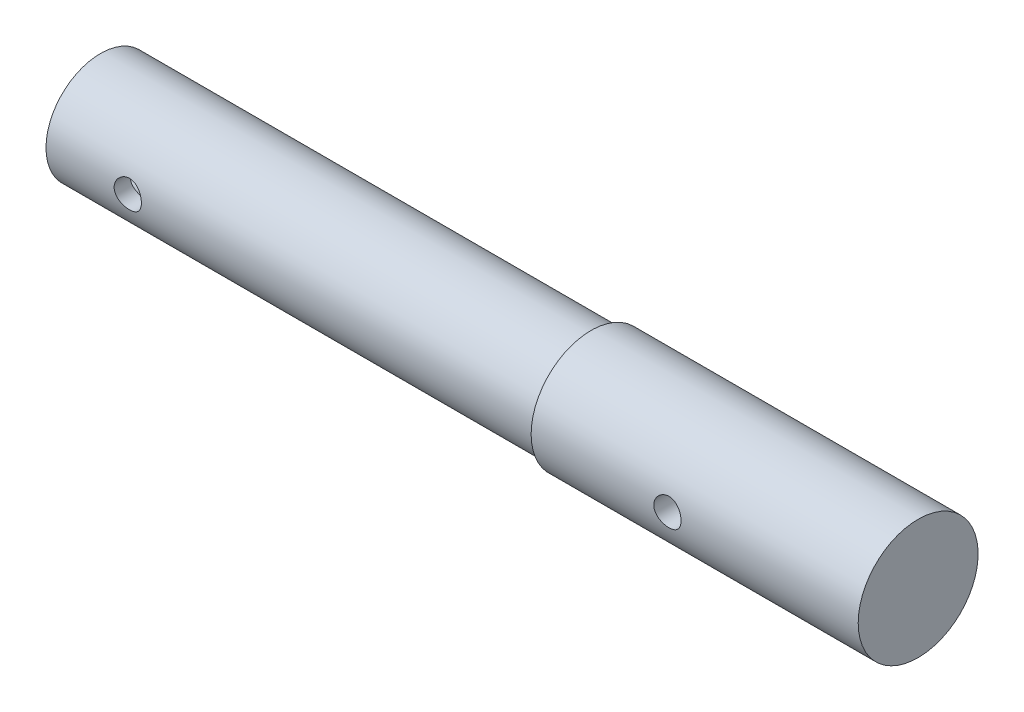
ISO-10303-21;
HEADER;
FILE_DESCRIPTION(('STEP AP214'),'2;1');
FILE_NAME('part.step','',(''),(''),'','','');
FILE_SCHEMA(('AUTOMOTIVE_DESIGN { 1 0 10303 214 1 1 1 1 }'));
ENDSEC;
DATA;
#1=APPLICATION_CONTEXT('core data for automotive mechanical design processes');
#2=APPLICATION_PROTOCOL_DEFINITION('international standard','automotive_design',2000,#1);
#3=PRODUCT_CONTEXT('',#1,'mechanical');
#4=PRODUCT('Part','Part','',(#3));
#5=PRODUCT_RELATED_PRODUCT_CATEGORY('part','',(#4));
#6=PRODUCT_DEFINITION_FORMATION('','',#4);
#7=PRODUCT_DEFINITION_CONTEXT('part definition',#1,'design');
#8=PRODUCT_DEFINITION('design','',#6,#7);
#9=PRODUCT_DEFINITION_SHAPE('','',#8);
#10=(LENGTH_UNIT() NAMED_UNIT(*) SI_UNIT(.MILLI.,.METRE.));
#11=(NAMED_UNIT(*) PLANE_ANGLE_UNIT() SI_UNIT($,.RADIAN.));
#12=(NAMED_UNIT(*) SI_UNIT($,.STERADIAN.) SOLID_ANGLE_UNIT());
#13=UNCERTAINTY_MEASURE_WITH_UNIT(LENGTH_MEASURE(1.E-05),#10,'distance_accuracy_value','');
#14=(GEOMETRIC_REPRESENTATION_CONTEXT(3) GLOBAL_UNCERTAINTY_ASSIGNED_CONTEXT((#13)) GLOBAL_UNIT_ASSIGNED_CONTEXT((#10,
#11,#12)) REPRESENTATION_CONTEXT('',''));
#15=CARTESIAN_POINT('',(0.,0.,0.));
#16=DIRECTION('',(0.,0.,1.));
#17=DIRECTION('',(1.,0.,0.));
#18=AXIS2_PLACEMENT_3D('',#15,#16,#17);
#19=CARTESIAN_POINT('',(0.,0.,0.));
#20=DIRECTION('',(-1.,0.,0.));
#21=DIRECTION('',(0.,0.,1.));
#22=AXIS2_PLACEMENT_3D('',#19,#20,#21);
#23=PLANE('',#22);
#24=CARTESIAN_POINT('',(0.,0.,0.));
#25=DIRECTION('',(-1.,0.,0.));
#26=DIRECTION('',(0.,0.,1.));
#27=AXIS2_PLACEMENT_3D('',#24,#25,#26);
#28=CIRCLE('',#27,11.);
#29=CARTESIAN_POINT('',(0.,0.,11.));
#30=VERTEX_POINT('',#29);
#31=EDGE_CURVE('E48',#30,#30,#28,.T.);
#32=ORIENTED_EDGE('',*,*,#31,.F.);
#33=EDGE_LOOP('',(#32));
#34=FACE_BOUND('',#33,.T.);
#35=ADVANCED_FACE('F32',(#34),#23,.F.);
#36=CARTESIAN_POINT('',(-150.,0.,0.));
#37=DIRECTION('',(-1.,0.,0.));
#38=DIRECTION('',(0.,0.,1.));
#39=AXIS2_PLACEMENT_3D('',#36,#37,#38);
#40=CYLINDRICAL_SURFACE('',#39,11.);
#41=CARTESIAN_POINT('',(-32.5,0.,-11.));
#42=CARTESIAN_POINT('',(-32.5000045318264,0.138518278596904,-10.9999974735185));
#43=CARTESIAN_POINT('',(-32.5115512275769,0.277090172258008,-10.9973570934613));
#44=CARTESIAN_POINT('',(-32.5573794760617,0.550288594599323,-10.987079320306));
#45=CARTESIAN_POINT('',(-32.5916763959553,0.684912392220729,-10.9794385496265));
#46=CARTESIAN_POINT('',(-32.6818680486319,0.946227671984917,-10.9600095312294));
#47=CARTESIAN_POINT('',(-32.7377393279807,1.07292759495648,-10.9482257885674));
#48=CARTESIAN_POINT('',(-32.8694171133809,1.31515227582566,-10.921778201627));
#49=CARTESIAN_POINT('',(-32.9452234208424,1.43067714503182,-10.9071143860398));
#50=CARTESIAN_POINT('',(-33.1160020446067,1.64926760444638,-10.8762265816814));
#51=CARTESIAN_POINT('',(-33.211252573475,1.75211293892049,-10.8599819758326));
#52=CARTESIAN_POINT('',(-33.4176189741372,1.9405138981661,-10.827906511833));
#53=CARTESIAN_POINT('',(-33.5287363506945,2.02606788121784,-10.8120756930933));
#54=CARTESIAN_POINT('',(-33.7653320552837,2.17844599401787,-10.7824158369221));
#55=CARTESIAN_POINT('',(-33.8909669963058,2.24503254356575,-10.7686131580577));
#56=CARTESIAN_POINT('',(-34.1520095005816,2.3560606971787,-10.7448696147509));
#57=CARTESIAN_POINT('',(-34.2874157920616,2.40050517717749,-10.7349282488168));
#58=CARTESIAN_POINT('',(-34.5617591871165,2.46525349412718,-10.7202434469831));
#59=CARTESIAN_POINT('',(-34.7005992631225,2.48594892680754,-10.715415797339));
#60=CARTESIAN_POINT('',(-34.9798582272131,2.50382988451487,-10.7112523406768));
#61=CARTESIAN_POINT('',(-35.1202769026623,2.50101853886553,-10.711915802658));
#62=CARTESIAN_POINT('',(-35.3957728833487,2.47228016958762,-10.7185835035919));
#63=CARTESIAN_POINT('',(-35.5309009061949,2.44681104599438,-10.7244819412976));
#64=CARTESIAN_POINT('',(-35.7949144861548,2.37420684920502,-10.7407873672743));
#65=CARTESIAN_POINT('',(-35.9237996676272,2.32707047404288,-10.7511946264744));
#66=CARTESIAN_POINT('',(-36.1729406718105,2.21205734402544,-10.7754474384537));
#67=CARTESIAN_POINT('',(-36.2931135177637,2.14400712086008,-10.7893215597825));
#68=CARTESIAN_POINT('',(-36.5205025531111,1.98921977920408,-10.8189276843241));
#69=CARTESIAN_POINT('',(-36.6277168402639,1.90247992237134,-10.8346599596346));
#70=CARTESIAN_POINT('',(-36.828778561821,1.71036518003517,-10.8666615287251));
#71=CARTESIAN_POINT('',(-36.9222544265164,1.60460166742828,-10.882934773515));
#72=CARTESIAN_POINT('',(-37.0902058887071,1.37871229840973,-10.9138502597158));
#73=CARTESIAN_POINT('',(-37.1646810866995,1.25858614009081,-10.9284924668293));
#74=CARTESIAN_POINT('',(-37.2926203879715,1.00690799179916,-10.9545497424637));
#75=CARTESIAN_POINT('',(-37.3460327736223,0.875328834348164,-10.9659568484873));
#76=CARTESIAN_POINT('',(-37.4298840058679,0.604745122491704,-10.9841998956698));
#77=CARTESIAN_POINT('',(-37.4603264658222,0.465741739663725,-10.9910365557784));
#78=CARTESIAN_POINT('',(-37.4968262374727,0.187439840192737,-10.9992650071756));
#79=CARTESIAN_POINT('',(-37.5033906913167,0.0482110923370417,-11.0007700184113));
#80=CARTESIAN_POINT('',(-37.4933269601471,-0.229353886680101,-10.9984842255063));
#81=CARTESIAN_POINT('',(-37.476700480594,-0.367690182720856,-10.9946938107912));
#82=CARTESIAN_POINT('',(-37.4211468330946,-0.637841677218458,-10.9823148103741));
#83=CARTESIAN_POINT('',(-37.3824884535563,-0.769715036814425,-10.973784087055));
#84=CARTESIAN_POINT('',(-37.2842689725429,-1.0251039308776,-10.9528806132367));
#85=CARTESIAN_POINT('',(-37.2247059957467,-1.14861871432289,-10.9405075180554));
#86=CARTESIAN_POINT('',(-37.0853308564447,-1.38586085256056,-10.9130143275095));
#87=CARTESIAN_POINT('',(-37.0052243732268,-1.49941068522719,-10.8978552985532));
#88=CARTESIAN_POINT('',(-36.8274206715598,-1.71163773579052,-10.866546095646));
#89=CARTESIAN_POINT('',(-36.7297209734532,-1.8103128535797,-10.8503957821912));
#90=CARTESIAN_POINT('',(-36.5171690348666,-1.99201706218096,-10.8185287714487));
#91=CARTESIAN_POINT('',(-36.4020127582132,-2.07469366594062,-10.8028272119253));
#92=CARTESIAN_POINT('',(-36.1591536093297,-2.21953814406553,-10.7740023321604));
#93=CARTESIAN_POINT('',(-36.0314512920404,-2.28170692501017,-10.7608788979592));
#94=CARTESIAN_POINT('',(-35.7678195304311,-2.38333597241928,-10.7388274870674));
#95=CARTESIAN_POINT('',(-35.6319426762567,-2.42292716221705,-10.7298753781702));
#96=CARTESIAN_POINT('',(-35.3552330933009,-2.47865258340365,-10.7171411058581));
#97=CARTESIAN_POINT('',(-35.2144012348636,-2.49479091341614,-10.7133580391079));
#98=CARTESIAN_POINT('',(-34.9353413806891,-2.50296739214165,-10.7114502943222));
#99=CARTESIAN_POINT('',(-34.7971304006664,-2.49556548501071,-10.7131941458177));
#100=CARTESIAN_POINT('',(-34.5239810898117,-2.45813115403283,-10.7218446846914));
#101=CARTESIAN_POINT('',(-34.3890427138895,-2.42809904217009,-10.7287513008948));
#102=CARTESIAN_POINT('',(-34.1267566026337,-2.34653692360609,-10.7468826027048));
#103=CARTESIAN_POINT('',(-33.9993803088585,-2.29509457527995,-10.758089666867));
#104=CARTESIAN_POINT('',(-33.7549852930994,-2.1722453660688,-10.783564723281));
#105=CARTESIAN_POINT('',(-33.6379677496745,-2.10083623731223,-10.7978330631966));
#106=CARTESIAN_POINT('',(-33.4148655723447,-1.9382499689105,-10.828211072634));
#107=CARTESIAN_POINT('',(-33.3090742777926,-1.84667645642835,-10.8443540558786));
#108=CARTESIAN_POINT('',(-33.114176814918,-1.64715628932418,-10.8764454859305));
#109=CARTESIAN_POINT('',(-33.025074529034,-1.53920583540676,-10.8923938866665));
#110=CARTESIAN_POINT('',(-32.8648619397663,-1.30814060515057,-10.9225693389041));
#111=CARTESIAN_POINT('',(-32.7940261766669,-1.1848316218762,-10.9367686161711));
#112=CARTESIAN_POINT('',(-32.674200029337,-0.927755967711694,-10.9615640551399));
#113=CARTESIAN_POINT('',(-32.6251920052133,-0.793997844337698,-10.9721631246672));
#114=CARTESIAN_POINT('',(-32.5587720938239,-0.550163071539624,-10.9867559512784));
#115=CARTESIAN_POINT('',(-32.5367760123107,-0.441368111138491,-10.9916908558499));
#116=CARTESIAN_POINT('',(-32.5073885264207,-0.221726814930917,-10.9983138080738));
#117=CARTESIAN_POINT('',(-32.4999963723808,-0.110880584717101,-11.0000020223883));
#118=CARTESIAN_POINT('',(-32.5,0.,-11.));
#119=B_SPLINE_CURVE_WITH_KNOTS('',3,(#41,#42,#43,#44,#45,#46,#47,#48,#49,#50,#51,#52,#53,#54,
#55,#56,#57,#58,#59,#60,#61,#62,#63,#64,#65,#66,#67,#68,#69,#70,#71,#72,#73,#74,#75,#76,#77,#78,
#79,#80,#81,#82,#83,#84,#85,#86,#87,#88,#89,#90,#91,#92,#93,#94,#95,#96,#97,#98,#99,#100,#101,
#102,#103,#104,#105,#106,#107,#108,#109,#110,#111,#112,#113,#114,#115,#116,#117,#118),
.UNSPECIFIED.,.T.,.F.,(4,2,2,2,2,2,2,2,2,2,2,2,2,2,2,2,2,2,2,2,2,2,2,2,2,2,2,2,2,2,2,2,2,2,2,2,
2,2,4),(0.,0.415148849633315,0.830578406996929,1.24555761755319,1.66053269430525,
2.08192389396808,2.50335508365802,2.92985362973413,3.35629676538239,3.77560244898082,
4.19485231368758,4.60581714174235,5.01680666753971,5.43130157438851,5.84585725297979,
6.27011531803704,6.69438230269862,7.11968464096647,7.54492006169895,7.96106941916762,
8.37718817463627,8.78833576149036,9.19952024123083,9.61696129328768,10.0344612272567,
10.460313215404,10.8861463755948,11.3094844190899,11.732748471094,12.1460204395145,
12.5592867105954,12.9708773657615,13.382514789318,13.8031102578591,14.2238034502007,
14.6504927745347,15.0768366452215,15.4091704772436,15.74148724914),.UNSPECIFIED.);
#120=CARTESIAN_POINT('',(-32.5,0.,-11.));
#121=VERTEX_POINT('',#120);
#122=EDGE_CURVE('E10',#121,#121,#119,.T.);
#123=ORIENTED_EDGE('',*,*,#122,.T.);
#124=EDGE_LOOP('',(#123));
#125=FACE_BOUND('',#124,.T.);
#126=CARTESIAN_POINT('',(-32.5,0.,11.));
#127=CARTESIAN_POINT('',(-32.5000045318264,-0.138518278596904,10.9999974735185));
#128=CARTESIAN_POINT('',(-32.5115512275769,-0.277090172258008,10.9973570934613));
#129=CARTESIAN_POINT('',(-32.5573794760617,-0.550288594599323,10.987079320306));
#130=CARTESIAN_POINT('',(-32.5916763959553,-0.684912392220729,10.9794385496265));
#131=CARTESIAN_POINT('',(-32.6818680486319,-0.946227671984917,10.9600095312294));
#132=CARTESIAN_POINT('',(-32.7377393279807,-1.07292759495648,10.9482257885674));
#133=CARTESIAN_POINT('',(-32.8694171133809,-1.31515227582566,10.921778201627));
#134=CARTESIAN_POINT('',(-32.9452234208424,-1.43067714503182,10.9071143860398));
#135=CARTESIAN_POINT('',(-33.1160020446067,-1.64926760444638,10.8762265816814));
#136=CARTESIAN_POINT('',(-33.211252573475,-1.75211293892049,10.8599819758326));
#137=CARTESIAN_POINT('',(-33.4176189741372,-1.9405138981661,10.827906511833));
#138=CARTESIAN_POINT('',(-33.5287363506945,-2.02606788121784,10.8120756930933));
#139=CARTESIAN_POINT('',(-33.7653320552837,-2.17844599401787,10.7824158369221));
#140=CARTESIAN_POINT('',(-33.8909669963058,-2.24503254356575,10.7686131580577));
#141=CARTESIAN_POINT('',(-34.1520095005816,-2.3560606971787,10.7448696147509));
#142=CARTESIAN_POINT('',(-34.2874157920616,-2.40050517717749,10.7349282488168));
#143=CARTESIAN_POINT('',(-34.5617591871165,-2.46525349412718,10.7202434469831));
#144=CARTESIAN_POINT('',(-34.7005992631225,-2.48594892680754,10.715415797339));
#145=CARTESIAN_POINT('',(-34.9798582272131,-2.50382988451487,10.7112523406768));
#146=CARTESIAN_POINT('',(-35.1202769026623,-2.50101853886553,10.711915802658));
#147=CARTESIAN_POINT('',(-35.3957728833487,-2.47228016958762,10.7185835035919));
#148=CARTESIAN_POINT('',(-35.5309009061949,-2.44681104599438,10.7244819412976));
#149=CARTESIAN_POINT('',(-35.7949144861548,-2.37420684920502,10.7407873672743));
#150=CARTESIAN_POINT('',(-35.9237996676272,-2.32707047404288,10.7511946264744));
#151=CARTESIAN_POINT('',(-36.1729406718105,-2.21205734402544,10.7754474384537));
#152=CARTESIAN_POINT('',(-36.2931135177637,-2.14400712086008,10.7893215597825));
#153=CARTESIAN_POINT('',(-36.5205025531111,-1.98921977920408,10.8189276843241));
#154=CARTESIAN_POINT('',(-36.6277168402639,-1.90247992237134,10.8346599596346));
#155=CARTESIAN_POINT('',(-36.828778561821,-1.71036518003517,10.8666615287251));
#156=CARTESIAN_POINT('',(-36.9222544265164,-1.60460166742828,10.882934773515));
#157=CARTESIAN_POINT('',(-37.0902058887071,-1.37871229840973,10.9138502597158));
#158=CARTESIAN_POINT('',(-37.1646810866995,-1.25858614009081,10.9284924668293));
#159=CARTESIAN_POINT('',(-37.2926203879715,-1.00690799179916,10.9545497424637));
#160=CARTESIAN_POINT('',(-37.3460327736223,-0.875328834348164,10.9659568484873));
#161=CARTESIAN_POINT('',(-37.4298840058679,-0.604745122491704,10.9841998956698));
#162=CARTESIAN_POINT('',(-37.4603264658222,-0.465741739663725,10.9910365557784));
#163=CARTESIAN_POINT('',(-37.4968262374727,-0.187439840192737,10.9992650071756));
#164=CARTESIAN_POINT('',(-37.5033906913167,-0.048211092337042,11.0007700184113));
#165=CARTESIAN_POINT('',(-37.4933269601471,0.229353886680101,10.9984842255063));
#166=CARTESIAN_POINT('',(-37.476700480594,0.367690182720856,10.9946938107912));
#167=CARTESIAN_POINT('',(-37.4211468330946,0.637841677218458,10.9823148103741));
#168=CARTESIAN_POINT('',(-37.3824884535563,0.769715036814425,10.973784087055));
#169=CARTESIAN_POINT('',(-37.2842689725429,1.0251039308776,10.9528806132367));
#170=CARTESIAN_POINT('',(-37.2247059957467,1.14861871432289,10.9405075180554));
#171=CARTESIAN_POINT('',(-37.0853308564447,1.38586085256056,10.9130143275095));
#172=CARTESIAN_POINT('',(-37.0052243732268,1.49941068522719,10.8978552985532));
#173=CARTESIAN_POINT('',(-36.8274206715598,1.71163773579052,10.866546095646));
#174=CARTESIAN_POINT('',(-36.7297209734532,1.8103128535797,10.8503957821912));
#175=CARTESIAN_POINT('',(-36.5171690348666,1.99201706218096,10.8185287714487));
#176=CARTESIAN_POINT('',(-36.4020127582132,2.07469366594062,10.8028272119253));
#177=CARTESIAN_POINT('',(-36.1591536093297,2.21953814406553,10.7740023321604));
#178=CARTESIAN_POINT('',(-36.0314512920404,2.28170692501017,10.7608788979592));
#179=CARTESIAN_POINT('',(-35.7678195304311,2.38333597241928,10.7388274870674));
#180=CARTESIAN_POINT('',(-35.6319426762567,2.42292716221705,10.7298753781702));
#181=CARTESIAN_POINT('',(-35.3552330933009,2.47865258340365,10.7171411058581));
#182=CARTESIAN_POINT('',(-35.2144012348636,2.49479091341614,10.7133580391079));
#183=CARTESIAN_POINT('',(-34.9353413806891,2.50296739214165,10.7114502943222));
#184=CARTESIAN_POINT('',(-34.7971304006664,2.49556548501071,10.7131941458177));
#185=CARTESIAN_POINT('',(-34.5239810898117,2.45813115403283,10.7218446846914));
#186=CARTESIAN_POINT('',(-34.3890427138895,2.42809904217009,10.7287513008948));
#187=CARTESIAN_POINT('',(-34.1267566026337,2.34653692360609,10.7468826027048));
#188=CARTESIAN_POINT('',(-33.9993803088585,2.29509457527995,10.758089666867));
#189=CARTESIAN_POINT('',(-33.7549852930994,2.1722453660688,10.783564723281));
#190=CARTESIAN_POINT('',(-33.6379677496745,2.10083623731223,10.7978330631966));
#191=CARTESIAN_POINT('',(-33.4148655723447,1.9382499689105,10.828211072634));
#192=CARTESIAN_POINT('',(-33.3090742777926,1.84667645642835,10.8443540558786));
#193=CARTESIAN_POINT('',(-33.114176814918,1.64715628932418,10.8764454859305));
#194=CARTESIAN_POINT('',(-33.025074529034,1.53920583540676,10.8923938866665));
#195=CARTESIAN_POINT('',(-32.8648619397663,1.30814060515057,10.9225693389041));
#196=CARTESIAN_POINT('',(-32.7940261766669,1.1848316218762,10.9367686161711));
#197=CARTESIAN_POINT('',(-32.674200029337,0.927755967711693,10.9615640551399));
#198=CARTESIAN_POINT('',(-32.6251920052133,0.793997844337699,10.9721631246672));
#199=CARTESIAN_POINT('',(-32.5587720938239,0.550163071539624,10.9867559512784));
#200=CARTESIAN_POINT('',(-32.5367760123107,0.44136811113849,10.9916908558499));
#201=CARTESIAN_POINT('',(-32.5073885264207,0.221726814930917,10.9983138080738));
#202=CARTESIAN_POINT('',(-32.4999963723808,0.110880584717101,11.0000020223883));
#203=CARTESIAN_POINT('',(-32.5,0.,11.));
#204=B_SPLINE_CURVE_WITH_KNOTS('',3,(#126,#127,#128,#129,#130,#131,#132,#133,#134,#135,#136,
#137,#138,#139,#140,#141,#142,#143,#144,#145,#146,#147,#148,#149,#150,#151,#152,#153,#154,#155,
#156,#157,#158,#159,#160,#161,#162,#163,#164,#165,#166,#167,#168,#169,#170,#171,#172,#173,#174,
#175,#176,#177,#178,#179,#180,#181,#182,#183,#184,#185,#186,#187,#188,#189,#190,#191,#192,#193,
#194,#195,#196,#197,#198,#199,#200,#201,#202,#203),.UNSPECIFIED.,.T.,.F.,(4,2,2,2,2,2,2,2,2,2,2,
2,2,2,2,2,2,2,2,2,2,2,2,2,2,2,2,2,2,2,2,2,2,2,2,2,2,2,4),(0.,0.415148849633315,
0.830578406996929,1.24555761755319,1.66053269430525,2.08192389396808,2.50335508365802,
2.92985362973413,3.35629676538239,3.77560244898082,4.19485231368758,4.60581714174235,
5.01680666753971,5.43130157438851,5.84585725297979,6.27011531803704,6.69438230269862,
7.11968464096647,7.54492006169895,7.96106941916762,8.37718817463627,8.78833576149036,
9.19952024123083,9.61696129328768,10.0344612272567,10.460313215404,10.8861463755948,
11.3094844190899,11.732748471094,12.1460204395145,12.5592867105954,12.9708773657615,
13.382514789318,13.8031102578591,14.2238034502007,14.6504927745347,15.0768366452215,
15.4091704772436,15.74148724914),.UNSPECIFIED.);
#205=CARTESIAN_POINT('',(-32.5,0.,11.));
#206=VERTEX_POINT('',#205);
#207=EDGE_CURVE('E43',#206,#206,#204,.T.);
#208=ORIENTED_EDGE('',*,*,#207,.T.);
#209=EDGE_LOOP('',(#208));
#210=FACE_BOUND('',#209,.T.);
#211=CARTESIAN_POINT('',(-60.,0.,0.));
#212=DIRECTION('',(-1.,0.,0.));
#213=DIRECTION('',(0.,0.,1.));
#214=AXIS2_PLACEMENT_3D('',#211,#212,#213);
#215=CIRCLE('',#214,11.);
#216=CARTESIAN_POINT('',(-60.,0.,11.));
#217=VERTEX_POINT('',#216);
#218=EDGE_CURVE('E120',#217,#217,#215,.T.);
#219=ORIENTED_EDGE('',*,*,#218,.F.);
#220=EDGE_LOOP('',(#219));
#221=FACE_BOUND('',#220,.T.);
#222=ORIENTED_EDGE('',*,*,#31,.T.);
#223=EDGE_LOOP('',(#222));
#224=FACE_BOUND('',#223,.T.);
#225=ADVANCED_FACE('F59',(#125,#210,#221,#224),#40,.T.);
#226=CARTESIAN_POINT('',(-60.,11.,0.));
#227=DIRECTION('',(1.,0.,0.));
#228=DIRECTION('',(0.,0.,-1.));
#229=AXIS2_PLACEMENT_3D('',#226,#227,#228);
#230=PLANE('',#229);
#231=CARTESIAN_POINT('',(-60.,0.,0.));
#232=DIRECTION('',(-1.,0.,0.));
#233=DIRECTION('',(0.,0.,1.));
#234=AXIS2_PLACEMENT_3D('',#231,#232,#233);
#235=CIRCLE('',#234,10.);
#236=CARTESIAN_POINT('',(-60.,0.,10.));
#237=VERTEX_POINT('',#236);
#238=EDGE_CURVE('E122',#237,#237,#235,.T.);
#239=ORIENTED_EDGE('',*,*,#238,.F.);
#240=EDGE_LOOP('',(#239));
#241=FACE_BOUND('',#240,.T.);
#242=ORIENTED_EDGE('',*,*,#218,.T.);
#243=EDGE_LOOP('',(#242));
#244=FACE_BOUND('',#243,.T.);
#245=ADVANCED_FACE('F78',(#241,#244),#230,.F.);
#246=CARTESIAN_POINT('',(-150.,0.,0.));
#247=DIRECTION('',(-1.,0.,0.));
#248=DIRECTION('',(0.,0.,1.));
#249=AXIS2_PLACEMENT_3D('',#246,#247,#248);
#250=CYLINDRICAL_SURFACE('',#249,10.);
#251=CARTESIAN_POINT('',(-132.5,0.,10.));
#252=CARTESIAN_POINT('',(-132.50000387623,-0.13812681444955,9.99999766446687));
#253=CARTESIAN_POINT('',(-132.511485917956,-0.276296929717936,9.99710963553043));
#254=CARTESIAN_POINT('',(-132.557041918845,-0.548677206284219,9.98586856383157));
#255=CARTESIAN_POINT('',(-132.591128682563,-0.682885078117899,9.97751242366626));
#256=CARTESIAN_POINT('',(-132.680732089103,-0.943368120304292,9.9562604388672));
#257=CARTESIAN_POINT('',(-132.736222997859,-1.06965260571666,9.94337004736764));
#258=CARTESIAN_POINT('',(-132.866968983408,-1.3111202198407,9.91442239679369));
#259=CARTESIAN_POINT('',(-132.942224726865,-1.4263029739146,9.89836503090261));
#260=CARTESIAN_POINT('',(-133.11200131609,-1.64466987883485,9.86445689319489));
#261=CARTESIAN_POINT('',(-133.206852624932,-1.74759281676841,9.84657845246877));
#262=CARTESIAN_POINT('',(-133.412420341515,-1.93624821200552,9.81122700196561));
#263=CARTESIAN_POINT('',(-133.523138538245,-2.02197872824865,9.79375403816446));
#264=CARTESIAN_POINT('',(-133.759325377895,-2.17504423799829,9.7609129283028));
#265=CARTESIAN_POINT('',(-133.884988718015,-2.2420870265419,9.74557990774685));
#266=CARTESIAN_POINT('',(-134.146247352767,-2.35399484758457,9.71915824696694));
#267=CARTESIAN_POINT('',(-134.281841055553,-2.39886342573356,9.70806892824031));
#268=CARTESIAN_POINT('',(-134.556239163669,-2.46425806134127,9.69167461160538));
#269=CARTESIAN_POINT('',(-134.69492482673,-2.48525378055341,9.68625818328352));
#270=CARTESIAN_POINT('',(-134.973947614999,-2.50376962511068,9.68148937432652));
#271=CARTESIAN_POINT('',(-135.11428446782,-2.50129356969685,9.68213600713214));
#272=CARTESIAN_POINT('',(-135.389026346242,-2.4733108743995,9.68932009194695));
#273=CARTESIAN_POINT('',(-135.523492702442,-2.44836390031772,9.69571438345489));
#274=CARTESIAN_POINT('',(-135.786268418185,-2.37704031150499,9.71344516118448));
#275=CARTESIAN_POINT('',(-135.914577338382,-2.33066217011566,9.72478199948731));
#276=CARTESIAN_POINT('',(-136.162896693754,-2.21731579656199,9.75125189842765));
#277=CARTESIAN_POINT('',(-136.282810286316,-2.15014444538821,9.76642212449693));
#278=CARTESIAN_POINT('',(-136.509864516261,-1.99726046002492,9.79882851409985));
#279=CARTESIAN_POINT('',(-136.617002913445,-1.91154458134807,9.81606503891046));
#280=CARTESIAN_POINT('',(-136.818672692824,-1.72110570780203,9.85126467566485));
#281=CARTESIAN_POINT('',(-136.912757483436,-1.61591043027643,9.86923449130001));
#282=CARTESIAN_POINT('',(-137.082035404106,-1.39101986250616,9.90343275964593));
#283=CARTESIAN_POINT('',(-137.157227957106,-1.27132412951323,9.91966115915679));
#284=CARTESIAN_POINT('',(-137.286750977041,-1.02019314780232,9.9486288682365));
#285=CARTESIAN_POINT('',(-137.341008900424,-0.888718988681035,9.96135600212878));
#286=CARTESIAN_POINT('',(-137.426528842849,-0.618126680238136,9.98179861652361));
#287=CARTESIAN_POINT('',(-137.457795260697,-0.479009998584142,9.98951505565468));
#288=CARTESIAN_POINT('',(-137.495762609265,-0.200899950650048,9.99892498785624));
#289=CARTESIAN_POINT('',(-137.503071710126,-0.0619945333136858,10.0007675584713));
#290=CARTESIAN_POINT('',(-137.494584996574,0.215054791335845,9.99864674690754));
#291=CARTESIAN_POINT('',(-137.478791262001,0.353198766074324,9.99468388736421));
#292=CARTESIAN_POINT('',(-137.425048486014,0.622690447960811,9.98149301878918));
#293=CARTESIAN_POINT('',(-137.387431227538,0.754108531614574,9.97234390309647));
#294=CARTESIAN_POINT('',(-137.291488193286,1.00876215408752,9.94981177723595));
#295=CARTESIAN_POINT('',(-137.233160326145,1.13199686505441,9.93642833949965));
#296=CARTESIAN_POINT('',(-137.096273118542,1.3692052240497,9.9065551321037));
#297=CARTESIAN_POINT('',(-137.017373146006,1.48297573639293,9.89001445610999));
#298=CARTESIAN_POINT('',(-136.842016818671,1.69587768940551,9.85574181979587));
#299=CARTESIAN_POINT('',(-136.745557433971,1.79500659828874,9.83800965421577));
#300=CARTESIAN_POINT('',(-136.534996731927,1.97831761345414,9.80281594932498));
#301=CARTESIAN_POINT('',(-136.420520495001,2.06207311270184,9.78537173637463));
#302=CARTESIAN_POINT('',(-136.178778942552,2.20918459835603,9.75321463970069));
#303=CARTESIAN_POINT('',(-136.051514195049,2.272541490269,9.73850163474941));
#304=CARTESIAN_POINT('',(-135.788490462656,2.37658570101222,9.71363491194665));
#305=CARTESIAN_POINT('',(-135.652787286146,2.4174073277393,9.70345425375809));
#306=CARTESIAN_POINT('',(-135.376150603575,2.47557609990488,9.68877906706585));
#307=CARTESIAN_POINT('',(-135.235218248298,2.49292837912651,9.68428329504044));
#308=CARTESIAN_POINT('',(-134.956464960231,2.50339765056083,9.68158168701612));
#309=CARTESIAN_POINT('',(-134.818670941456,2.49719649630131,9.68319887888034));
#310=CARTESIAN_POINT('',(-134.546160185556,2.46229546385366,9.69213181672143));
#311=CARTESIAN_POINT('',(-134.411443386645,2.43359603781098,9.69944744817731));
#312=CARTESIAN_POINT('',(-134.149652568224,2.35488553240494,9.71885434473222));
#313=CARTESIAN_POINT('',(-134.022537824599,2.30500234113402,9.73091692061057));
#314=CARTESIAN_POINT('',(-133.778391028811,2.18544152267502,9.7584625954084));
#315=CARTESIAN_POINT('',(-133.661360378022,2.11576115005695,9.77394616867808));
#316=CARTESIAN_POINT('',(-133.437408951663,1.95644624772858,9.80709390439337));
#317=CARTESIAN_POINT('',(-133.330831544293,1.86633860485377,9.82480441386302));
#318=CARTESIAN_POINT('',(-133.134088258674,1.66964895198289,9.86013378743769));
#319=CARTESIAN_POINT('',(-133.043926283145,1.56306303543525,9.87775262878421));
#320=CARTESIAN_POINT('',(-132.880981152392,1.33411264450432,9.91129426079449));
#321=CARTESIAN_POINT('',(-132.808542310547,1.21149737052732,9.92718055609783));
#322=CARTESIAN_POINT('',(-132.685420895099,0.955443432517465,9.95508208291861));
#323=CARTESIAN_POINT('',(-132.634722732252,0.822012605727902,9.96710008666301));
#324=CARTESIAN_POINT('',(-132.564046949451,0.57401708873912,9.98413432609236));
#325=CARTESIAN_POINT('',(-132.540081261578,0.460633618180113,9.99004308421151));
#326=CARTESIAN_POINT('',(-132.50805676063,0.231510119227137,9.9979767538658));
#327=CARTESIAN_POINT('',(-132.499996751158,0.115770268737693,10.0000019575149));
#328=CARTESIAN_POINT('',(-132.5,0.,10.));
#329=B_SPLINE_CURVE_WITH_KNOTS('',3,(#251,#252,#253,#254,#255,#256,#257,#258,#259,#260,#261,
#262,#263,#264,#265,#266,#267,#268,#269,#270,#271,#272,#273,#274,#275,#276,#277,#278,#279,#280,
#281,#282,#283,#284,#285,#286,#287,#288,#289,#290,#291,#292,#293,#294,#295,#296,#297,#298,#299,
#300,#301,#302,#303,#304,#305,#306,#307,#308,#309,#310,#311,#312,#313,#314,#315,#316,#317,#318,
#319,#320,#321,#322,#323,#324,#325,#326,#327,#328),.UNSPECIFIED.,.T.,.F.,(4,2,2,2,2,2,2,2,2,2,2,
2,2,2,2,2,2,2,2,2,2,2,2,2,2,2,2,2,2,2,2,2,2,2,2,2,2,2,4),(0.,0.413956187453145,
0.828147062939833,1.24184150381018,1.6555499002822,2.07690725728562,2.49831215966772,
2.92597745909678,3.35357435282279,3.77260491835114,4.19156730193362,4.60037495017229,
5.00921172448929,5.42217546461996,5.83521151399137,6.26002501620565,6.68485149269278,
7.11113715020724,7.53734122819938,7.95263848254327,8.36789835193438,8.77700457528928,
9.18615212209351,9.60255979281118,10.0190393835223,10.4457418201299,10.8724253125471,
11.2965375769763,11.7205570543047,12.1323963400748,12.5442273493652,12.9536066760887,
13.3630428023796,13.7831596069298,14.2033761629382,14.6312030917577,15.0587227304538,
15.4057040491338,15.7526592674819),.UNSPECIFIED.);
#330=CARTESIAN_POINT('',(-132.5,0.,10.));
#331=VERTEX_POINT('',#330);
#332=EDGE_CURVE('E86',#331,#331,#329,.T.);
#333=ORIENTED_EDGE('',*,*,#332,.T.);
#334=EDGE_LOOP('',(#333));
#335=FACE_BOUND('',#334,.T.);
#336=CARTESIAN_POINT('',(-132.5,0.,-10.));
#337=CARTESIAN_POINT('',(-132.50000387623,0.13812681444955,-9.99999766446687));
#338=CARTESIAN_POINT('',(-132.511485917956,0.276296929717936,-9.99710963553043));
#339=CARTESIAN_POINT('',(-132.557041918845,0.548677206284219,-9.98586856383157));
#340=CARTESIAN_POINT('',(-132.591128682563,0.682885078117899,-9.97751242366626));
#341=CARTESIAN_POINT('',(-132.680732089103,0.943368120304292,-9.9562604388672));
#342=CARTESIAN_POINT('',(-132.736222997859,1.06965260571666,-9.94337004736764));
#343=CARTESIAN_POINT('',(-132.866968983408,1.3111202198407,-9.91442239679369));
#344=CARTESIAN_POINT('',(-132.942224726865,1.4263029739146,-9.89836503090261));
#345=CARTESIAN_POINT('',(-133.11200131609,1.64466987883485,-9.86445689319489));
#346=CARTESIAN_POINT('',(-133.206852624932,1.74759281676841,-9.84657845246877));
#347=CARTESIAN_POINT('',(-133.412420341515,1.93624821200552,-9.81122700196561));
#348=CARTESIAN_POINT('',(-133.523138538245,2.02197872824865,-9.79375403816446));
#349=CARTESIAN_POINT('',(-133.759325377895,2.17504423799829,-9.7609129283028));
#350=CARTESIAN_POINT('',(-133.884988718015,2.2420870265419,-9.74557990774685));
#351=CARTESIAN_POINT('',(-134.146247352767,2.35399484758457,-9.71915824696694));
#352=CARTESIAN_POINT('',(-134.281841055553,2.39886342573356,-9.70806892824031));
#353=CARTESIAN_POINT('',(-134.556239163669,2.46425806134127,-9.69167461160538));
#354=CARTESIAN_POINT('',(-134.69492482673,2.48525378055341,-9.68625818328352));
#355=CARTESIAN_POINT('',(-134.973947614999,2.50376962511068,-9.68148937432652));
#356=CARTESIAN_POINT('',(-135.11428446782,2.50129356969685,-9.68213600713214));
#357=CARTESIAN_POINT('',(-135.389026346242,2.4733108743995,-9.68932009194695));
#358=CARTESIAN_POINT('',(-135.523492702442,2.44836390031772,-9.69571438345489));
#359=CARTESIAN_POINT('',(-135.786268418185,2.37704031150499,-9.71344516118448));
#360=CARTESIAN_POINT('',(-135.914577338382,2.33066217011566,-9.72478199948731));
#361=CARTESIAN_POINT('',(-136.162896693754,2.21731579656199,-9.75125189842765));
#362=CARTESIAN_POINT('',(-136.282810286316,2.15014444538821,-9.76642212449693));
#363=CARTESIAN_POINT('',(-136.509864516261,1.99726046002492,-9.79882851409985));
#364=CARTESIAN_POINT('',(-136.617002913445,1.91154458134807,-9.81606503891046));
#365=CARTESIAN_POINT('',(-136.818672692824,1.72110570780203,-9.85126467566485));
#366=CARTESIAN_POINT('',(-136.912757483436,1.61591043027643,-9.86923449130001));
#367=CARTESIAN_POINT('',(-137.082035404106,1.39101986250616,-9.90343275964593));
#368=CARTESIAN_POINT('',(-137.157227957106,1.27132412951323,-9.91966115915679));
#369=CARTESIAN_POINT('',(-137.286750977041,1.02019314780232,-9.9486288682365));
#370=CARTESIAN_POINT('',(-137.341008900424,0.888718988681035,-9.96135600212878));
#371=CARTESIAN_POINT('',(-137.426528842849,0.618126680238136,-9.98179861652361));
#372=CARTESIAN_POINT('',(-137.457795260697,0.479009998584142,-9.98951505565468));
#373=CARTESIAN_POINT('',(-137.495762609265,0.200899950650048,-9.99892498785624));
#374=CARTESIAN_POINT('',(-137.503071710126,0.0619945333136858,-10.0007675584713));
#375=CARTESIAN_POINT('',(-137.494584996574,-0.215054791335845,-9.99864674690754));
#376=CARTESIAN_POINT('',(-137.478791262001,-0.353198766074324,-9.99468388736421));
#377=CARTESIAN_POINT('',(-137.425048486014,-0.622690447960811,-9.98149301878918));
#378=CARTESIAN_POINT('',(-137.387431227538,-0.754108531614574,-9.97234390309647));
#379=CARTESIAN_POINT('',(-137.291488193286,-1.00876215408752,-9.94981177723595));
#380=CARTESIAN_POINT('',(-137.233160326145,-1.13199686505441,-9.93642833949965));
#381=CARTESIAN_POINT('',(-137.096273118542,-1.3692052240497,-9.9065551321037));
#382=CARTESIAN_POINT('',(-137.017373146006,-1.48297573639293,-9.89001445610999));
#383=CARTESIAN_POINT('',(-136.842016818671,-1.69587768940551,-9.85574181979587));
#384=CARTESIAN_POINT('',(-136.745557433971,-1.79500659828874,-9.83800965421577));
#385=CARTESIAN_POINT('',(-136.534996731927,-1.97831761345414,-9.80281594932498));
#386=CARTESIAN_POINT('',(-136.420520495001,-2.06207311270184,-9.78537173637463));
#387=CARTESIAN_POINT('',(-136.178778942552,-2.20918459835603,-9.75321463970069));
#388=CARTESIAN_POINT('',(-136.051514195049,-2.272541490269,-9.73850163474941));
#389=CARTESIAN_POINT('',(-135.788490462656,-2.37658570101222,-9.71363491194665));
#390=CARTESIAN_POINT('',(-135.652787286146,-2.4174073277393,-9.70345425375809));
#391=CARTESIAN_POINT('',(-135.376150603575,-2.47557609990488,-9.68877906706585));
#392=CARTESIAN_POINT('',(-135.235218248298,-2.49292837912651,-9.68428329504044));
#393=CARTESIAN_POINT('',(-134.956464960231,-2.50339765056083,-9.68158168701612));
#394=CARTESIAN_POINT('',(-134.818670941456,-2.49719649630131,-9.68319887888034));
#395=CARTESIAN_POINT('',(-134.546160185556,-2.46229546385366,-9.69213181672143));
#396=CARTESIAN_POINT('',(-134.411443386645,-2.43359603781098,-9.69944744817731));
#397=CARTESIAN_POINT('',(-134.149652568224,-2.35488553240494,-9.71885434473222));
#398=CARTESIAN_POINT('',(-134.022537824599,-2.30500234113402,-9.73091692061057));
#399=CARTESIAN_POINT('',(-133.778391028811,-2.18544152267502,-9.7584625954084));
#400=CARTESIAN_POINT('',(-133.661360378022,-2.11576115005695,-9.77394616867808));
#401=CARTESIAN_POINT('',(-133.437408951663,-1.95644624772858,-9.80709390439337));
#402=CARTESIAN_POINT('',(-133.330831544293,-1.86633860485377,-9.82480441386302));
#403=CARTESIAN_POINT('',(-133.134088258674,-1.66964895198289,-9.86013378743769));
#404=CARTESIAN_POINT('',(-133.043926283145,-1.56306303543525,-9.87775262878421));
#405=CARTESIAN_POINT('',(-132.880981152392,-1.33411264450432,-9.91129426079449));
#406=CARTESIAN_POINT('',(-132.808542310547,-1.21149737052732,-9.92718055609783));
#407=CARTESIAN_POINT('',(-132.685420895099,-0.955443432517465,-9.95508208291861));
#408=CARTESIAN_POINT('',(-132.634722732252,-0.822012605727902,-9.96710008666301));
#409=CARTESIAN_POINT('',(-132.564046949451,-0.57401708873912,-9.98413432609236));
#410=CARTESIAN_POINT('',(-132.540081261578,-0.460633618180113,-9.99004308421151));
#411=CARTESIAN_POINT('',(-132.50805676063,-0.231510119227137,-9.9979767538658));
#412=CARTESIAN_POINT('',(-132.499996751158,-0.115770268737693,-10.0000019575149));
#413=CARTESIAN_POINT('',(-132.5,0.,-10.));
#414=B_SPLINE_CURVE_WITH_KNOTS('',3,(#336,#337,#338,#339,#340,#341,#342,#343,#344,#345,#346,
#347,#348,#349,#350,#351,#352,#353,#354,#355,#356,#357,#358,#359,#360,#361,#362,#363,#364,#365,
#366,#367,#368,#369,#370,#371,#372,#373,#374,#375,#376,#377,#378,#379,#380,#381,#382,#383,#384,
#385,#386,#387,#388,#389,#390,#391,#392,#393,#394,#395,#396,#397,#398,#399,#400,#401,#402,#403,
#404,#405,#406,#407,#408,#409,#410,#411,#412,#413),.UNSPECIFIED.,.T.,.F.,(4,2,2,2,2,2,2,2,2,2,2,
2,2,2,2,2,2,2,2,2,2,2,2,2,2,2,2,2,2,2,2,2,2,2,2,2,2,2,4),(0.,0.413956187453145,
0.828147062939833,1.24184150381018,1.6555499002822,2.07690725728562,2.49831215966772,
2.92597745909678,3.35357435282279,3.77260491835114,4.19156730193362,4.60037495017229,
5.00921172448929,5.42217546461996,5.83521151399137,6.26002501620565,6.68485149269278,
7.11113715020724,7.53734122819938,7.95263848254327,8.36789835193438,8.77700457528928,
9.18615212209351,9.60255979281118,10.0190393835223,10.4457418201299,10.8724253125471,
11.2965375769763,11.7205570543047,12.1323963400748,12.5442273493652,12.9536066760887,
13.3630428023796,13.7831596069298,14.2033761629382,14.6312030917577,15.0587227304538,
15.4057040491338,15.7526592674819),.UNSPECIFIED.);
#415=CARTESIAN_POINT('',(-132.5,0.,-10.));
#416=VERTEX_POINT('',#415);
#417=EDGE_CURVE('E82',#416,#416,#414,.T.);
#418=ORIENTED_EDGE('',*,*,#417,.T.);
#419=EDGE_LOOP('',(#418));
#420=FACE_BOUND('',#419,.T.);
#421=CARTESIAN_POINT('',(-150.,0.,0.));
#422=DIRECTION('',(-1.,0.,0.));
#423=DIRECTION('',(0.,0.,1.));
#424=AXIS2_PLACEMENT_3D('',#421,#422,#423);
#425=CIRCLE('',#424,9.99999999999999);
#426=CARTESIAN_POINT('',(-150.,0.,9.99999999999999));
#427=VERTEX_POINT('',#426);
#428=EDGE_CURVE('E127',#427,#427,#425,.T.);
#429=ORIENTED_EDGE('',*,*,#428,.F.);
#430=EDGE_LOOP('',(#429));
#431=FACE_BOUND('',#430,.T.);
#432=ORIENTED_EDGE('',*,*,#238,.T.);
#433=EDGE_LOOP('',(#432));
#434=FACE_BOUND('',#433,.T.);
#435=ADVANCED_FACE('F74',(#335,#420,#431,#434),#250,.T.);
#436=CARTESIAN_POINT('',(-150.,9.99999999999999,0.));
#437=DIRECTION('',(1.,0.,0.));
#438=DIRECTION('',(0.,0.,-1.));
#439=AXIS2_PLACEMENT_3D('',#436,#437,#438);
#440=PLANE('',#439);
#441=CARTESIAN_POINT('',(-150.,0.,0.));
#442=DIRECTION('',(-1.,0.,0.));
#443=DIRECTION('',(0.,0.,1.));
#444=AXIS2_PLACEMENT_3D('',#441,#442,#443);
#445=CIRCLE('',#444,7.);
#446=CARTESIAN_POINT('',(-150.,0.,7.));
#447=VERTEX_POINT('',#446);
#448=EDGE_CURVE('E91',#447,#447,#445,.T.);
#449=ORIENTED_EDGE('',*,*,#448,.F.);
#450=EDGE_LOOP('',(#449));
#451=FACE_BOUND('',#450,.T.);
#452=ORIENTED_EDGE('',*,*,#428,.T.);
#453=EDGE_LOOP('',(#452));
#454=FACE_BOUND('',#453,.T.);
#455=ADVANCED_FACE('F67',(#451,#454),#440,.F.);
#456=CARTESIAN_POINT('',(-35.,0.,-11.));
#457=DIRECTION('',(0.,0.,1.));
#458=DIRECTION('',(1.,0.,0.));
#459=AXIS2_PLACEMENT_3D('',#456,#457,#458);
#460=CYLINDRICAL_SURFACE('',#459,2.5);
#461=ORIENTED_EDGE('',*,*,#207,.F.);
#462=EDGE_LOOP('',(#461));
#463=FACE_BOUND('',#462,.T.);
#464=ORIENTED_EDGE('',*,*,#122,.F.);
#465=EDGE_LOOP('',(#464));
#466=FACE_BOUND('',#465,.T.);
#467=ADVANCED_FACE('F62',(#463,#466),#460,.F.);
#468=CARTESIAN_POINT('',(-120.,0.,0.));
#469=DIRECTION('',(-1.,0.,0.));
#470=DIRECTION('',(0.,0.,1.));
#471=AXIS2_PLACEMENT_3D('',#468,#469,#470);
#472=CYLINDRICAL_SURFACE('',#471,7.);
#473=CARTESIAN_POINT('',(-132.5,0.,7.));
#474=CARTESIAN_POINT('',(-132.499997175958,0.135839760518734,7.0000020295295));
#475=CARTESIAN_POINT('',(-132.511106757233,0.271659429947532,6.99601056603649));
#476=CARTESIAN_POINT('',(-132.555091287192,0.539264896606897,6.98048404948616));
#477=CARTESIAN_POINT('',(-132.587965405065,0.671050847614626,6.96894928437749));
#478=CARTESIAN_POINT('',(-132.674185141267,0.926692116674318,6.93958109810981));
#479=CARTESIAN_POINT('',(-132.72749355972,1.0505613714592,6.92175912724346));
#480=CARTESIAN_POINT('',(-132.852888719368,1.28759585298402,6.88161078032354));
#481=CARTESIAN_POINT('',(-132.924979959449,1.40075850640075,6.85928332539979));
#482=CARTESIAN_POINT('',(-133.088843132116,1.61758802805346,6.81147377429754));
#483=CARTESIAN_POINT('',(-133.181218731005,1.72078015672851,6.78590827445072));
#484=CARTESIAN_POINT('',(-133.38174636379,1.9105819932243,6.73493522536265));
#485=CARTESIAN_POINT('',(-133.489902583716,1.99718728701347,6.70952771990193));
#486=CARTESIAN_POINT('',(-133.723397792776,2.15423735561843,6.6608007016897));
#487=CARTESIAN_POINT('',(-133.849194743517,2.2240352979483,6.63758107761794));
#488=CARTESIAN_POINT('',(-134.111703664704,2.34127572230002,6.59714352451506));
#489=CARTESIAN_POINT('',(-134.248411714568,2.38872619231546,6.57992345154766));
#490=CARTESIAN_POINT('',(-134.523422836203,2.45809130448527,6.55432038222057));
#491=CARTESIAN_POINT('',(-134.661469306943,2.48090519407331,6.54562733379002));
#492=CARTESIAN_POINT('',(-134.939683631824,2.5031615222748,6.53715061879806));
#493=CARTESIAN_POINT('',(-135.079850692542,2.50261249605974,6.53736369856128));
#494=CARTESIAN_POINT('',(-135.350355655052,2.4788507897233,6.54640588297195));
#495=CARTESIAN_POINT('',(-135.480818353,2.45685161763647,6.5547736366904));
#496=CARTESIAN_POINT('',(-135.736061527183,2.39280851055059,6.57842082174383));
#497=CARTESIAN_POINT('',(-135.860841224651,2.35076183734613,6.59370119723068));
#498=CARTESIAN_POINT('',(-136.103773745786,2.247095668441,6.62975170487814));
#499=CARTESIAN_POINT('',(-136.221769602659,2.18514195933257,6.65061447775041));
#500=CARTESIAN_POINT('',(-136.44605638665,2.04365272690695,6.69544469696369));
#501=CARTESIAN_POINT('',(-136.552343533307,1.96411154980232,6.71941314064672));
#502=CARTESIAN_POINT('',(-136.756959591371,1.78403149047106,6.76952498465894));
#503=CARTESIAN_POINT('',(-136.854417859249,1.68251331515437,6.79571223474351));
#504=CARTESIAN_POINT('',(-137.031171682835,1.46426184534913,6.84605473605516));
#505=CARTESIAN_POINT('',(-137.110464942299,1.34752663019369,6.87020973014028));
#506=CARTESIAN_POINT('',(-137.249480609939,1.10010034292174,6.91416998722002));
#507=CARTESIAN_POINT('',(-137.30893823989,0.9692491124252,6.93391532170415));
#508=CARTESIAN_POINT('',(-137.40471582416,0.698523468127244,6.96639167687355));
#509=CARTESIAN_POINT('',(-137.441045060763,0.558652699053765,6.97912551125635));
#510=CARTESIAN_POINT('',(-137.48791915066,0.281205091813834,6.99566202632136));
#511=CARTESIAN_POINT('',(-137.499638130746,0.143850613169092,6.99987103999093));
#512=CARTESIAN_POINT('',(-137.50034512199,-0.130909371573395,7.00012297890716));
#513=CARTESIAN_POINT('',(-137.489337626992,-0.268314862212673,6.99616751856457));
#514=CARTESIAN_POINT('',(-137.445813862678,-0.534368698997769,6.98080349995239));
#515=CARTESIAN_POINT('',(-137.414045244202,-0.663155848081396,6.96965417819419));
#516=CARTESIAN_POINT('',(-137.330863405264,-0.913499444029989,6.94128245796679));
#517=CARTESIAN_POINT('',(-137.279447634171,-1.03505494970017,6.9240592709991));
#518=CARTESIAN_POINT('',(-137.156841146598,-1.27131790851501,6.88465739573328));
#519=CARTESIAN_POINT('',(-137.085133519501,-1.38573546298722,6.86235262462324));
#520=CARTESIAN_POINT('',(-136.924572504893,-1.6012793689737,6.81528395513799));
#521=CARTESIAN_POINT('',(-136.835713235226,-1.70240114063959,6.79051921453452));
#522=CARTESIAN_POINT('',(-136.637870367271,-1.89402292059752,6.73966040960453));
#523=CARTESIAN_POINT('',(-136.52807528698,-1.98368681906968,6.71356479866297));
#524=CARTESIAN_POINT('',(-136.294458729996,-2.14345525781597,6.6642787599771));
#525=CARTESIAN_POINT('',(-136.170636568871,-2.21355884309554,6.64108847411014));
#526=CARTESIAN_POINT('',(-135.911935190764,-2.33208686094211,6.60040332956607));
#527=CARTESIAN_POINT('',(-135.77704432949,-2.3804881075604,6.58291456759544));
#528=CARTESIAN_POINT('',(-135.50023989928,-2.45361419016748,6.55601442004241));
#529=CARTESIAN_POINT('',(-135.358330179338,-2.4783518546378,6.54659865821929));
#530=CARTESIAN_POINT('',(-135.080479520627,-2.50236255506862,6.53745596427834));
#531=CARTESIAN_POINT('',(-134.944676785576,-2.50304426978181,6.53719306756498));
#532=CARTESIAN_POINT('',(-134.675002329345,-2.48247035008868,6.54503319463773));
#533=CARTESIAN_POINT('',(-134.541130458752,-2.46121642244207,6.55313556754228));
#534=CARTESIAN_POINT('',(-134.282499414628,-2.39843007607192,6.57636700427786));
#535=CARTESIAN_POINT('',(-134.157595900994,-2.35741961008934,6.59131474248996));
#536=CARTESIAN_POINT('',(-133.916357318133,-2.25672644338169,6.6264632931512));
#537=CARTESIAN_POINT('',(-133.800024319056,-2.19703924956893,6.64666536944648));
#538=CARTESIAN_POINT('',(-133.573074250048,-2.05730313071903,6.69127230994833));
#539=CARTESIAN_POINT('',(-133.463011959137,-1.97640371595171,6.71583400336864));
#540=CARTESIAN_POINT('',(-133.25757249534,-1.79790863011922,6.76580411328318));
#541=CARTESIAN_POINT('',(-133.162199779649,-1.70030791033581,6.79121278393859));
#542=CARTESIAN_POINT('',(-132.984278097183,-1.48566252339524,6.84145445667706));
#543=CARTESIAN_POINT('',(-132.902546960209,-1.36791750616704,6.86620367070764));
#544=CARTESIAN_POINT('',(-132.760092336162,-1.11951131249463,6.91104924401846));
#545=CARTESIAN_POINT('',(-132.699367259797,-0.988851114158929,6.93114595526313));
#546=CARTESIAN_POINT('',(-132.600859689691,-0.717646336524977,6.96446006180832));
#547=CARTESIAN_POINT('',(-132.563174591837,-0.577062560467773,6.97764821973896));
#548=CARTESIAN_POINT('',(-132.512751125361,-0.290976881134812,6.99541542277591));
#549=CARTESIAN_POINT('',(-132.500003024394,-0.145476919097823,6.99999782648543));
#550=CARTESIAN_POINT('',(-132.5,0.,7.));
#551=B_SPLINE_CURVE_WITH_KNOTS('',3,(#473,#474,#475,#476,#477,#478,#479,#480,#481,#482,#483,
#484,#485,#486,#487,#488,#489,#490,#491,#492,#493,#494,#495,#496,#497,#498,#499,#500,#501,#502,
#503,#504,#505,#506,#507,#508,#509,#510,#511,#512,#513,#514,#515,#516,#517,#518,#519,#520,#521,
#522,#523,#524,#525,#526,#527,#528,#529,#530,#531,#532,#533,#534,#535,#536,#537,#538,#539,#540,
#541,#542,#543,#544,#545,#546,#547,#548,#549,#550),.UNSPECIFIED.,.T.,.F.,(4,2,2,2,2,2,2,2,2,2,2,
2,2,2,2,2,2,2,2,2,2,2,2,2,2,2,2,2,2,2,2,2,2,2,2,2,2,2,4),(0.,0.406983217142953,
0.813950899519936,1.2201812042563,1.62650889940499,2.04714572459521,2.46789433314938,
2.90289606780334,3.33774219500352,3.75611562378724,4.17433620956452,4.57019246497945,
4.96610280426153,5.36904149669467,5.77210990935866,6.19956653135138,6.62707715847137,
7.06008524763625,7.49291944485571,7.9045852991208,8.31616976000824,8.71369326802824,
9.1112684008579,9.5200585695312,9.92898918269313,10.3593838463852,10.7897995195909,
11.2206739431307,11.6513146487842,12.0566930957309,12.4620400035307,12.8572208236401,
13.2524967861626,13.6670344525245,14.0816976535747,14.5159343578492,14.9501382011315,
15.3861650682913,15.822021730055),.UNSPECIFIED.);
#552=CARTESIAN_POINT('',(-132.5,0.,7.));
#553=VERTEX_POINT('',#552);
#554=EDGE_CURVE('E35',#553,#553,#551,.T.);
#555=ORIENTED_EDGE('',*,*,#554,.T.);
#556=EDGE_LOOP('',(#555));
#557=FACE_BOUND('',#556,.T.);
#558=CARTESIAN_POINT('',(-132.5,0.,-7.));
#559=CARTESIAN_POINT('',(-132.499997175958,-0.135839760518734,-7.0000020295295));
#560=CARTESIAN_POINT('',(-132.511106757233,-0.271659429947532,-6.99601056603649));
#561=CARTESIAN_POINT('',(-132.555091287192,-0.539264896606897,-6.98048404948616));
#562=CARTESIAN_POINT('',(-132.587965405065,-0.671050847614626,-6.96894928437749));
#563=CARTESIAN_POINT('',(-132.674185141267,-0.926692116674318,-6.93958109810981));
#564=CARTESIAN_POINT('',(-132.72749355972,-1.0505613714592,-6.92175912724346));
#565=CARTESIAN_POINT('',(-132.852888719368,-1.28759585298402,-6.88161078032354));
#566=CARTESIAN_POINT('',(-132.924979959449,-1.40075850640075,-6.85928332539979));
#567=CARTESIAN_POINT('',(-133.088843132116,-1.61758802805346,-6.81147377429754));
#568=CARTESIAN_POINT('',(-133.181218731005,-1.72078015672851,-6.78590827445072));
#569=CARTESIAN_POINT('',(-133.38174636379,-1.9105819932243,-6.73493522536265));
#570=CARTESIAN_POINT('',(-133.489902583716,-1.99718728701347,-6.70952771990193));
#571=CARTESIAN_POINT('',(-133.723397792776,-2.15423735561843,-6.6608007016897));
#572=CARTESIAN_POINT('',(-133.849194743517,-2.2240352979483,-6.63758107761794));
#573=CARTESIAN_POINT('',(-134.111703664704,-2.34127572230002,-6.59714352451506));
#574=CARTESIAN_POINT('',(-134.248411714568,-2.38872619231546,-6.57992345154766));
#575=CARTESIAN_POINT('',(-134.523422836203,-2.45809130448527,-6.55432038222057));
#576=CARTESIAN_POINT('',(-134.661469306943,-2.48090519407331,-6.54562733379002));
#577=CARTESIAN_POINT('',(-134.939683631824,-2.5031615222748,-6.53715061879806));
#578=CARTESIAN_POINT('',(-135.079850692542,-2.50261249605974,-6.53736369856128));
#579=CARTESIAN_POINT('',(-135.350355655052,-2.4788507897233,-6.54640588297195));
#580=CARTESIAN_POINT('',(-135.480818353,-2.45685161763647,-6.5547736366904));
#581=CARTESIAN_POINT('',(-135.736061527183,-2.39280851055059,-6.57842082174383));
#582=CARTESIAN_POINT('',(-135.860841224651,-2.35076183734613,-6.59370119723068));
#583=CARTESIAN_POINT('',(-136.103773745786,-2.247095668441,-6.62975170487814));
#584=CARTESIAN_POINT('',(-136.221769602659,-2.18514195933257,-6.65061447775041));
#585=CARTESIAN_POINT('',(-136.44605638665,-2.04365272690695,-6.69544469696369));
#586=CARTESIAN_POINT('',(-136.552343533307,-1.96411154980232,-6.71941314064672));
#587=CARTESIAN_POINT('',(-136.756959591371,-1.78403149047106,-6.76952498465894));
#588=CARTESIAN_POINT('',(-136.854417859249,-1.68251331515437,-6.79571223474351));
#589=CARTESIAN_POINT('',(-137.031171682835,-1.46426184534913,-6.84605473605516));
#590=CARTESIAN_POINT('',(-137.110464942299,-1.34752663019369,-6.87020973014028));
#591=CARTESIAN_POINT('',(-137.249480609939,-1.10010034292174,-6.91416998722002));
#592=CARTESIAN_POINT('',(-137.30893823989,-0.9692491124252,-6.93391532170415));
#593=CARTESIAN_POINT('',(-137.40471582416,-0.698523468127244,-6.96639167687355));
#594=CARTESIAN_POINT('',(-137.441045060763,-0.558652699053765,-6.97912551125635));
#595=CARTESIAN_POINT('',(-137.48791915066,-0.281205091813834,-6.99566202632136));
#596=CARTESIAN_POINT('',(-137.499638130746,-0.143850613169092,-6.99987103999093));
#597=CARTESIAN_POINT('',(-137.50034512199,0.130909371573395,-7.00012297890716));
#598=CARTESIAN_POINT('',(-137.489337626992,0.268314862212673,-6.99616751856457));
#599=CARTESIAN_POINT('',(-137.445813862678,0.534368698997769,-6.98080349995239));
#600=CARTESIAN_POINT('',(-137.414045244202,0.663155848081396,-6.96965417819419));
#601=CARTESIAN_POINT('',(-137.330863405264,0.913499444029989,-6.94128245796679));
#602=CARTESIAN_POINT('',(-137.279447634171,1.03505494970017,-6.9240592709991));
#603=CARTESIAN_POINT('',(-137.156841146598,1.27131790851501,-6.88465739573328));
#604=CARTESIAN_POINT('',(-137.085133519501,1.38573546298722,-6.86235262462324));
#605=CARTESIAN_POINT('',(-136.924572504893,1.6012793689737,-6.81528395513799));
#606=CARTESIAN_POINT('',(-136.835713235226,1.70240114063959,-6.79051921453452));
#607=CARTESIAN_POINT('',(-136.637870367271,1.89402292059752,-6.73966040960453));
#608=CARTESIAN_POINT('',(-136.52807528698,1.98368681906968,-6.71356479866297));
#609=CARTESIAN_POINT('',(-136.294458729996,2.14345525781597,-6.6642787599771));
#610=CARTESIAN_POINT('',(-136.170636568871,2.21355884309554,-6.64108847411014));
#611=CARTESIAN_POINT('',(-135.911935190764,2.33208686094211,-6.60040332956607));
#612=CARTESIAN_POINT('',(-135.77704432949,2.3804881075604,-6.58291456759544));
#613=CARTESIAN_POINT('',(-135.50023989928,2.45361419016748,-6.55601442004241));
#614=CARTESIAN_POINT('',(-135.358330179338,2.4783518546378,-6.54659865821929));
#615=CARTESIAN_POINT('',(-135.080479520627,2.50236255506862,-6.53745596427834));
#616=CARTESIAN_POINT('',(-134.944676785576,2.50304426978181,-6.53719306756498));
#617=CARTESIAN_POINT('',(-134.675002329345,2.48247035008868,-6.54503319463773));
#618=CARTESIAN_POINT('',(-134.541130458752,2.46121642244207,-6.55313556754228));
#619=CARTESIAN_POINT('',(-134.282499414628,2.39843007607192,-6.57636700427786));
#620=CARTESIAN_POINT('',(-134.157595900994,2.35741961008934,-6.59131474248996));
#621=CARTESIAN_POINT('',(-133.916357318133,2.25672644338169,-6.6264632931512));
#622=CARTESIAN_POINT('',(-133.800024319056,2.19703924956893,-6.64666536944648));
#623=CARTESIAN_POINT('',(-133.573074250048,2.05730313071903,-6.69127230994833));
#624=CARTESIAN_POINT('',(-133.463011959137,1.97640371595171,-6.71583400336864));
#625=CARTESIAN_POINT('',(-133.25757249534,1.79790863011922,-6.76580411328318));
#626=CARTESIAN_POINT('',(-133.162199779649,1.70030791033581,-6.79121278393859));
#627=CARTESIAN_POINT('',(-132.984278097183,1.48566252339524,-6.84145445667706));
#628=CARTESIAN_POINT('',(-132.902546960209,1.36791750616704,-6.86620367070764));
#629=CARTESIAN_POINT('',(-132.760092336162,1.11951131249463,-6.91104924401846));
#630=CARTESIAN_POINT('',(-132.699367259797,0.988851114158929,-6.93114595526313));
#631=CARTESIAN_POINT('',(-132.600859689691,0.717646336524977,-6.96446006180832));
#632=CARTESIAN_POINT('',(-132.563174591837,0.577062560467773,-6.97764821973896));
#633=CARTESIAN_POINT('',(-132.512751125361,0.290976881134812,-6.99541542277591));
#634=CARTESIAN_POINT('',(-132.500003024394,0.145476919097823,-6.99999782648543));
#635=CARTESIAN_POINT('',(-132.5,0.,-7.));
#636=B_SPLINE_CURVE_WITH_KNOTS('',3,(#558,#559,#560,#561,#562,#563,#564,#565,#566,#567,#568,
#569,#570,#571,#572,#573,#574,#575,#576,#577,#578,#579,#580,#581,#582,#583,#584,#585,#586,#587,
#588,#589,#590,#591,#592,#593,#594,#595,#596,#597,#598,#599,#600,#601,#602,#603,#604,#605,#606,
#607,#608,#609,#610,#611,#612,#613,#614,#615,#616,#617,#618,#619,#620,#621,#622,#623,#624,#625,
#626,#627,#628,#629,#630,#631,#632,#633,#634,#635),.UNSPECIFIED.,.T.,.F.,(4,2,2,2,2,2,2,2,2,2,2,
2,2,2,2,2,2,2,2,2,2,2,2,2,2,2,2,2,2,2,2,2,2,2,2,2,2,2,4),(0.,0.406983217142953,
0.813950899519936,1.2201812042563,1.62650889940499,2.04714572459521,2.46789433314938,
2.90289606780334,3.33774219500352,3.75611562378724,4.17433620956452,4.57019246497945,
4.96610280426153,5.36904149669467,5.77210990935866,6.19956653135138,6.62707715847137,
7.06008524763625,7.49291944485571,7.9045852991208,8.31616976000824,8.71369326802824,
9.1112684008579,9.5200585695312,9.92898918269313,10.3593838463852,10.7897995195909,
11.2206739431307,11.6513146487842,12.0566930957309,12.4620400035307,12.8572208236401,
13.2524967861626,13.6670344525245,14.0816976535747,14.5159343578492,14.9501382011315,
15.3861650682913,15.822021730055),.UNSPECIFIED.);
#637=CARTESIAN_POINT('',(-132.5,0.,-7.));
#638=VERTEX_POINT('',#637);
#639=EDGE_CURVE('E56',#638,#638,#636,.T.);
#640=ORIENTED_EDGE('',*,*,#639,.T.);
#641=EDGE_LOOP('',(#640));
#642=FACE_BOUND('',#641,.T.);
#643=CARTESIAN_POINT('',(-120.,0.,0.));
#644=DIRECTION('',(-1.,0.,0.));
#645=DIRECTION('',(0.,0.,1.));
#646=AXIS2_PLACEMENT_3D('',#643,#644,#645);
#647=CIRCLE('',#646,7.);
#648=CARTESIAN_POINT('',(-120.,0.,7.));
#649=VERTEX_POINT('',#648);
#650=EDGE_CURVE('E92',#649,#649,#647,.T.);
#651=ORIENTED_EDGE('',*,*,#650,.F.);
#652=EDGE_LOOP('',(#651));
#653=FACE_BOUND('',#652,.T.);
#654=ORIENTED_EDGE('',*,*,#448,.T.);
#655=EDGE_LOOP('',(#654));
#656=FACE_BOUND('',#655,.T.);
#657=ADVANCED_FACE('F66',(#557,#642,#653,#656),#472,.F.);
#658=CARTESIAN_POINT('',(-120.,0.,0.));
#659=DIRECTION('',(-1.,0.,0.));
#660=DIRECTION('',(0.,0.,1.));
#661=AXIS2_PLACEMENT_3D('',#658,#659,#660);
#662=PLANE('',#661);
#663=ORIENTED_EDGE('',*,*,#650,.T.);
#664=EDGE_LOOP('',(#663));
#665=FACE_BOUND('',#664,.T.);
#666=ADVANCED_FACE('F99',(#665),#662,.T.);
#667=CARTESIAN_POINT('',(-135.,0.,-11.));
#668=DIRECTION('',(0.,0.,1.));
#669=DIRECTION('',(1.,0.,0.));
#670=AXIS2_PLACEMENT_3D('',#667,#668,#669);
#671=CYLINDRICAL_SURFACE('',#670,2.5);
#672=ORIENTED_EDGE('',*,*,#639,.F.);
#673=EDGE_LOOP('',(#672));
#674=FACE_BOUND('',#673,.T.);
#675=ORIENTED_EDGE('',*,*,#417,.F.);
#676=EDGE_LOOP('',(#675));
#677=FACE_BOUND('',#676,.T.);
#678=ADVANCED_FACE('F97',(#674,#677),#671,.F.);
#679=ORIENTED_EDGE('',*,*,#554,.F.);
#680=EDGE_LOOP('',(#679));
#681=FACE_BOUND('',#680,.T.);
#682=ORIENTED_EDGE('',*,*,#332,.F.);
#683=EDGE_LOOP('',(#682));
#684=FACE_BOUND('',#683,.T.);
#685=ADVANCED_FACE('F94',(#681,#684),#671,.F.);
#686=CLOSED_SHELL('',(#35,#225,#245,#435,#455,#467,#657,#666,#678,#685));
#687=MANIFOLD_SOLID_BREP('B2',#686);
#688=ADVANCED_BREP_SHAPE_REPRESENTATION('',(#18,#687),#14);
#689=SHAPE_DEFINITION_REPRESENTATION(#9,#688);
ENDSEC;
END-ISO-10303-21;
